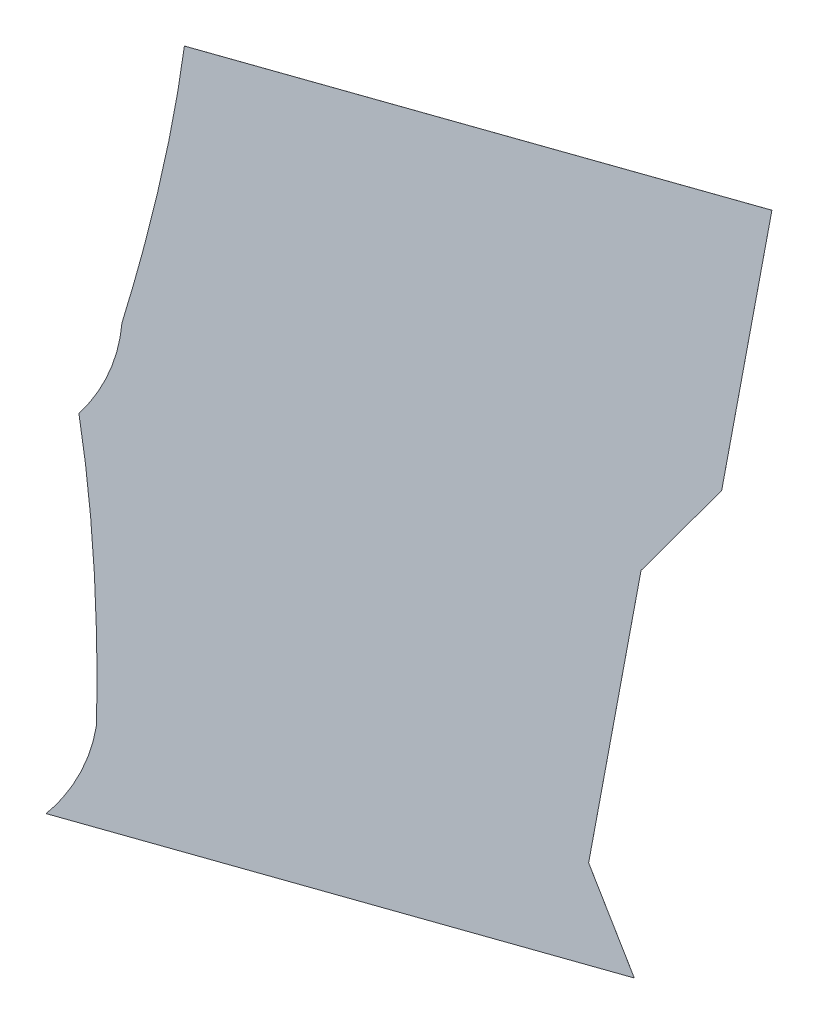
ISO-10303-21;
HEADER;
FILE_DESCRIPTION(('STEP AP214'),'2;1');
FILE_NAME('part.step','',(''),(''),'','','');
FILE_SCHEMA(('AUTOMOTIVE_DESIGN { 1 0 10303 214 1 1 1 1 }'));
ENDSEC;
DATA;
#1=APPLICATION_CONTEXT('core data for automotive mechanical design processes');
#2=APPLICATION_PROTOCOL_DEFINITION('international standard','automotive_design',2000,#1);
#3=PRODUCT_CONTEXT('',#1,'mechanical');
#4=PRODUCT('Part','Part','',(#3));
#5=PRODUCT_RELATED_PRODUCT_CATEGORY('part','',(#4));
#6=PRODUCT_DEFINITION_FORMATION('','',#4);
#7=PRODUCT_DEFINITION_CONTEXT('part definition',#1,'design');
#8=PRODUCT_DEFINITION('design','',#6,#7);
#9=PRODUCT_DEFINITION_SHAPE('','',#8);
#10=(LENGTH_UNIT() NAMED_UNIT(*) SI_UNIT(.MILLI.,.METRE.));
#11=(NAMED_UNIT(*) PLANE_ANGLE_UNIT() SI_UNIT($,.RADIAN.));
#12=(NAMED_UNIT(*) SI_UNIT($,.STERADIAN.) SOLID_ANGLE_UNIT());
#13=UNCERTAINTY_MEASURE_WITH_UNIT(LENGTH_MEASURE(1.E-05),#10,'distance_accuracy_value','');
#14=(GEOMETRIC_REPRESENTATION_CONTEXT(3) GLOBAL_UNCERTAINTY_ASSIGNED_CONTEXT((#13)) GLOBAL_UNIT_ASSIGNED_CONTEXT((#10,
#11,#12)) REPRESENTATION_CONTEXT('',''));
#15=CARTESIAN_POINT('',(0.,0.,0.));
#16=DIRECTION('',(0.,0.,1.));
#17=DIRECTION('',(1.,0.,0.));
#18=AXIS2_PLACEMENT_3D('',#15,#16,#17);
#19=CARTESIAN_POINT('',(151.680220925604,360.398931378131,313.47628043361));
#20=DIRECTION('',(0.887995978439146,-0.103444016227642,-0.448065260629073));
#21=DIRECTION('',(0.,-0.974370064785233,0.224951054343879));
#22=AXIS2_PLACEMENT_3D('',#19,#20,#21);
#23=PLANE('',#22);
#24=DIRECTION('',(0.459851217543135,0.199755631603012,0.865236699040776));
#25=VECTOR('',#24,1.);
#26=CARTESIAN_POINT('',(151.680220925604,360.418418779427,313.471781412523));
#27=LINE('',#26,#25);
#28=CARTESIAN_POINT('',(151.675622413428,360.416421223111,313.463129045533));
#29=VERTEX_POINT('',#28);
#30=CARTESIAN_POINT('',(151.680220925604,360.418418779427,313.471781412523));
#31=VERTEX_POINT('',#30);
#32=EDGE_CURVE('E505',#29,#31,#27,.T.);
#33=ORIENTED_EDGE('',*,*,#32,.F.);
#34=DIRECTION('',(0.,-0.974370064785233,0.224951054343879));
#35=VECTOR('',#34,1.);
#36=CARTESIAN_POINT('',(151.675622413428,360.396933821815,313.46762806662));
#37=LINE('',#36,#35);
#38=CARTESIAN_POINT('',(151.675622413428,434.624445357155,296.330856746703));
#39=VERTEX_POINT('',#38);
#40=EDGE_CURVE('E470',#39,#29,#37,.T.);
#41=ORIENTED_EDGE('',*,*,#40,.F.);
#42=DIRECTION('',(0.459851217543232,0.199755631604782,0.865236699040316));
#43=VECTOR('',#42,1.);
#44=CARTESIAN_POINT('',(151.680220925603,434.62644291347,296.339509113693));
#45=LINE('',#44,#43);
#46=CARTESIAN_POINT('',(151.680220925603,434.62644291347,296.339509113693));
#47=VERTEX_POINT('',#46);
#48=EDGE_CURVE('E514',#39,#47,#45,.T.);
#49=ORIENTED_EDGE('',*,*,#48,.T.);
#50=DIRECTION('',(0.,-0.974370064785233,0.224951054343879));
#51=VECTOR('',#50,1.);
#52=CARTESIAN_POINT('',(151.680220925604,360.398931378131,313.47628043361));
#53=LINE('',#52,#51);
#54=EDGE_CURVE('E476',#47,#31,#53,.T.);
#55=ORIENTED_EDGE('',*,*,#54,.T.);
#56=EDGE_LOOP('',(#33,#41,#49,#55));
#57=FACE_BOUND('',#56,.T.);
#58=ADVANCED_FACE('F231',(#57),#23,.T.);
#59=CARTESIAN_POINT('',(11.6802209255907,368.250898646985,386.069936995522));
#60=DIRECTION('',(-0.459851217543135,-0.199755631603012,-0.865236699040776));
#61=DIRECTION('',(0.123628089728887,-0.979282566119915,0.16038002096141));
#62=AXIS2_PLACEMENT_3D('',#59,#60,#61);
#63=ELLIPSE('',#62,146.750178018493,38.1);
#64=DIRECTION('',(-0.459851217543135,-0.199755631603012,-0.865236699040776));
#65=VECTOR('',#64,1.);
#66=SURFACE_OF_LINEAR_EXTRUSION('',#63,#65);
#67=DIRECTION('',(0.459851217553119,0.199755631607195,0.865236699034504));
#68=VECTOR('',#67,1.);
#69=CARTESIAN_POINT('',(29.5350343621642,448.852790168623,357.960589028568));
#70=LINE('',#69,#68);
#71=CARTESIAN_POINT('',(29.5350343621643,448.852790168623,357.960589028568));
#72=VERTEX_POINT('',#71);
#73=CARTESIAN_POINT('',(29.5396328743397,448.854787724939,357.969241395558));
#74=VERTEX_POINT('',#73);
#75=EDGE_CURVE('E571',#72,#74,#70,.T.);
#76=ORIENTED_EDGE('',*,*,#75,.F.);
#77=CARTESIAN_POINT('',(11.6756224134152,368.248901090669,386.061284628532));
#78=DIRECTION('',(-0.459851217543135,-0.199755631603012,-0.865236699040776));
#79=DIRECTION('',(0.123628089728887,-0.979282566119915,0.16038002096141));
#80=AXIS2_PLACEMENT_3D('',#77,#78,#79);
#81=ELLIPSE('',#80,146.750178018493,38.1);
#82=CARTESIAN_POINT('',(44.7456096076509,372.872862748157,367.417904990697));
#83=VERTEX_POINT('',#82);
#84=EDGE_CURVE('E480',#83,#72,#81,.F.);
#85=ORIENTED_EDGE('',*,*,#84,.F.);
#86=CARTESIAN_POINT('',(44.7456096076507,372.872862748157,367.417904990697));
#87=DIRECTION('',(0.459851217542959,0.199755631603108,0.865236699040847));
#88=VECTOR('',#87,1.);
#89=LINE('',#86,#88);
#90=CARTESIAN_POINT('',(44.750208119826,372.874860304473,367.426557357687));
#91=VERTEX_POINT('',#90);
#92=EDGE_CURVE('E489',#83,#91,#89,.T.);
#93=ORIENTED_EDGE('',*,*,#92,.T.);
#94=EDGE_CURVE('E479',#91,#74,#63,.F.);
#95=ORIENTED_EDGE('',*,*,#94,.T.);
#96=EDGE_LOOP('',(#76,#85,#93,#95));
#97=FACE_BOUND('',#96,.T.);
#98=ADVANCED_FACE('F496',(#97),#66,.F.);
#99=CARTESIAN_POINT('',(158.540110462806,532.810776324648,270.026013494281));
#100=DIRECTION('',(-0.459851217543135,-0.199755631603012,-0.865236699040776));
#101=DIRECTION('',(-0.88303358136935,0.,0.469309806177134));
#102=AXIS2_PLACEMENT_3D('',#99,#100,#101);
#103=PLANE('',#102);
#104=ORIENTED_EDGE('',*,*,#54,.F.);
#105=DIRECTION('',(0.40739376091098,0.818319076944367,-0.405443228923268));
#106=VECTOR('',#105,1.);
#107=CARTESIAN_POINT('',(151.680220925603,434.62644291347,296.339509113693));
#108=LINE('',#107,#106);
#109=CARTESIAN_POINT('',(151.691023901253,434.648142512015,296.328757860853));
#110=VERTEX_POINT('',#109);
#111=EDGE_CURVE('E561',#47,#110,#108,.T.);
#112=ORIENTED_EDGE('',*,*,#111,.T.);
#113=DIRECTION('',(-0.461479806504052,-0.778701236932887,0.425042082373233));
#114=VECTOR('',#113,1.);
#115=CARTESIAN_POINT('',(153.532901416258,437.756127474735,294.632312115188));
#116=LINE('',#115,#114);
#117=CARTESIAN_POINT('',(165.389197024359,457.762446116089,283.7121710744));
#118=VERTEX_POINT('',#117);
#119=EDGE_CURVE('E586',#118,#110,#116,.T.);
#120=ORIENTED_EDGE('',*,*,#119,.F.);
#121=DIRECTION('',(0.407393760911127,0.818319076943533,-0.405443228924805));
#122=VECTOR('',#121,1.);
#123=CARTESIAN_POINT('',(165.389197024359,457.762446116089,283.712171074399));
#124=LINE('',#123,#122);
#125=CARTESIAN_POINT('',(165.400000000008,457.784145714633,283.701419821559));
#126=VERTEX_POINT('',#125);
#127=EDGE_CURVE('E382',#118,#126,#124,.T.);
#128=ORIENTED_EDGE('',*,*,#127,.T.);
#129=DIRECTION('',(0.,-0.974370064785232,0.224951054343883));
#130=VECTOR('',#129,1.);
#131=CARTESIAN_POINT('',(165.400000000008,532.011657249972,266.564648501642));
#132=LINE('',#131,#130);
#133=CARTESIAN_POINT('',(165.400000000008,528.944340286029,267.272794420717));
#134=VERTEX_POINT('',#133);
#135=EDGE_CURVE('E370',#134,#126,#132,.T.);
#136=ORIENTED_EDGE('',*,*,#135,.F.);
#137=DIRECTION('',(-0.887995978439146,0.103444016227646,0.448065260629071));
#138=VECTOR('',#137,1.);
#139=CARTESIAN_POINT('',(178.529228317984,527.41489630187,260.648044702263));
#140=LINE('',#139,#138);
#141=CARTESIAN_POINT('',(37.7428251040463,543.815320777094,331.686087644713));
#142=VERTEX_POINT('',#141);
#143=EDGE_CURVE('E360',#134,#142,#140,.T.);
#144=ORIENTED_EDGE('',*,*,#143,.T.);
#145=CARTESIAN_POINT('',(-5.49560397189452E-12,468.575510617685,369.115914550579));
#146=DIRECTION('',(-0.459851217543135,-0.199755631603012,-0.865236699040776));
#147=DIRECTION('',(0.123628089728889,0.95047931378405,-0.285140613555117));
#148=AXIS2_PLACEMENT_3D('',#145,#146,#147);
#149=ELLIPSE('',#148,146.750178018493,38.1);
#150=CARTESIAN_POINT('',(35.0929894453342,472.963809633931,349.451767867731));
#151=VERTEX_POINT('',#150);
#152=EDGE_CURVE('E354',#151,#142,#149,.F.);
#153=ORIENTED_EDGE('',*,*,#152,.F.);
#154=DIRECTION('',(0.0162631616268608,0.972312119159766,-0.233119395394171));
#155=VECTOR('',#154,1.);
#156=CARTESIAN_POINT('',(35.1146516202199,474.258908068788,349.141257941792));
#157=LINE('',#156,#155);
#158=CARTESIAN_POINT('',(35.0926061893349,472.940896226231,349.457261535499));
#159=VERTEX_POINT('',#158);
#160=EDGE_CURVE('E387',#151,#159,#157,.F.);
#161=ORIENTED_EDGE('',*,*,#160,.T.);
#162=CARTESIAN_POINT('',(1.08355746927219,474.626220510447,367.143114969039));
#163=DIRECTION('',(-0.459851217543135,-0.199755631603012,-0.865236699040777));
#164=DIRECTION('',(0.408346031858665,-0.912805555850603,-0.00628772403605967));
#165=AXIS2_PLACEMENT_3D('',#162,#163,#164);
#166=ELLIPSE('',#165,39.8408559221603,38.1);
#167=CARTESIAN_POINT('',(29.5457266033037,448.877035910867,357.960866335735));
#168=VERTEX_POINT('',#167);
#169=EDGE_CURVE('E392',#168,#159,#166,.F.);
#170=ORIENTED_EDGE('',*,*,#169,.F.);
#171=DIRECTION('',(0.24830886703624,0.906574918937121,-0.341269135588514));
#172=VECTOR('',#171,1.);
#173=CARTESIAN_POINT('',(34.3183120304217,466.301730801358,351.401551226794));
#174=LINE('',#173,#172);
#175=EDGE_CURVE('E557',#168,#74,#174,.F.);
#176=ORIENTED_EDGE('',*,*,#175,.T.);
#177=ORIENTED_EDGE('',*,*,#94,.F.);
#178=DIRECTION('',(-0.126241724840681,0.979179490256282,-0.158967143682892));
#179=VECTOR('',#178,1.);
#180=CARTESIAN_POINT('',(45.8322516540238,364.48211347225,368.789097121692));
#181=LINE('',#180,#179);
#182=CARTESIAN_POINT('',(44.7532131423752,372.851552190998,367.430341366912));
#183=VERTEX_POINT('',#182);
#184=EDGE_CURVE('E471',#91,#183,#181,.F.);
#185=ORIENTED_EDGE('',*,*,#184,.T.);
#186=CARTESIAN_POINT('',(10.5966634563131,374.554059089428,385.190620879374));
#187=DIRECTION('',(-0.459851217543135,-0.199755631603012,-0.865236699040777));
#188=DIRECTION('',(0.408346031858667,0.817667842230929,-0.405798987242079));
#189=AXIS2_PLACEMENT_3D('',#186,#187,#188);
#190=ELLIPSE('',#189,39.8408559221603,38.1);
#191=CARTESIAN_POINT('',(37.5922025299442,348.95623707825,376.752903875654));
#192=VERTEX_POINT('',#191);
#193=EDGE_CURVE('E428',#192,#183,#190,.F.);
#194=ORIENTED_EDGE('',*,*,#193,.F.);
#195=DIRECTION('',(-0.887995978439146,0.103444016227646,0.448065260629071));
#196=VECTOR('',#195,1.);
#197=CARTESIAN_POINT('',(158.540110462806,334.866829406722,315.72497446348));
#198=LINE('',#197,#196);
#199=CARTESIAN_POINT('',(165.400000000008,334.067710332046,312.263609470842));
#200=VERTEX_POINT('',#199);
#201=EDGE_CURVE('E458',#200,#192,#198,.T.);
#202=ORIENTED_EDGE('',*,*,#201,.F.);
#203=DIRECTION('',(0.46147980650405,-0.88621822068465,-0.0406651388232901));
#204=VECTOR('',#203,1.);
#205=CARTESIAN_POINT('',(153.532901416258,356.857091022939,313.309326324616));
#206=LINE('',#205,#204);
#207=CARTESIAN_POINT('',(151.691023901253,360.394202270411,313.471630728379));
#208=VERTEX_POINT('',#207);
#209=EDGE_CURVE('E437',#208,#200,#206,.T.);
#210=ORIENTED_EDGE('',*,*,#209,.F.);
#211=DIRECTION('',(-0.407393760910533,0.913234927551786,0.00568248806907909));
#212=VECTOR('',#211,1.);
#213=CARTESIAN_POINT('',(151.691023901253,360.394202270411,313.471630728379));
#214=LINE('',#213,#212);
#215=EDGE_CURVE('E466',#208,#31,#214,.T.);
#216=ORIENTED_EDGE('',*,*,#215,.T.);
#217=EDGE_LOOP('',(#104,#112,#120,#128,#136,#144,#153,#161,#170,#176,#177,#185,#194,#202,#210,#216));
#218=FACE_BOUND('',#217,.T.);
#219=ADVANCED_FACE('F233',(#218),#103,.F.);
#220=CARTESIAN_POINT('',(158.535511950631,359.597814747139,310.006263073981));
#221=DIRECTION('',(-0.459851217543135,-0.199755631603012,-0.865236699040776));
#222=DIRECTION('',(0.88303358136935,-0.205731877933245,-0.421812859661817));
#223=AXIS2_PLACEMENT_3D('',#220,#221,#222);
#224=PLANE('',#223);
#225=ORIENTED_EDGE('',*,*,#40,.T.);
#226=DIRECTION('',(-0.407393760910533,0.913234927551786,0.00568248806907909));
#227=VECTOR('',#226,1.);
#228=CARTESIAN_POINT('',(151.686425389077,360.392204714095,313.462978361389));
#229=LINE('',#228,#227);
#230=CARTESIAN_POINT('',(151.686425389077,360.392204714095,313.462978361389));
#231=VERTEX_POINT('',#230);
#232=EDGE_CURVE('E472',#231,#29,#229,.T.);
#233=ORIENTED_EDGE('',*,*,#232,.F.);
#234=DIRECTION('',(0.46147980650405,-0.88621822068465,-0.0406651388232901));
#235=VECTOR('',#234,1.);
#236=CARTESIAN_POINT('',(153.528302904082,356.855093466623,313.300673957626));
#237=LINE('',#236,#235);
#238=CARTESIAN_POINT('',(165.395401487833,334.06571277573,312.254957103851));
#239=VERTEX_POINT('',#238);
#240=EDGE_CURVE('E433',#231,#239,#237,.T.);
#241=ORIENTED_EDGE('',*,*,#240,.T.);
#242=DIRECTION('',(-0.887995978439146,0.103444016227646,0.448065260629071));
#243=VECTOR('',#242,1.);
#244=CARTESIAN_POINT('',(158.53551195063,334.864831850405,315.71632209649));
#245=LINE('',#244,#243);
#246=CARTESIAN_POINT('',(37.5876040177687,348.954239521934,376.744251508664));
#247=VERTEX_POINT('',#246);
#248=EDGE_CURVE('E449',#239,#247,#245,.T.);
#249=ORIENTED_EDGE('',*,*,#248,.T.);
#250=CARTESIAN_POINT('',(10.5920649441376,374.552061533112,385.181968512383));
#251=DIRECTION('',(-0.459851217543135,-0.199755631603012,-0.865236699040777));
#252=DIRECTION('',(0.408346031858667,0.817667842230929,-0.405798987242079));
#253=AXIS2_PLACEMENT_3D('',#250,#251,#252);
#254=ELLIPSE('',#253,39.8408559221603,38.1);
#255=CARTESIAN_POINT('',(44.7486146301999,372.849554634682,367.421688999922));
#256=VERTEX_POINT('',#255);
#257=EDGE_CURVE('E446',#247,#256,#254,.F.);
#258=ORIENTED_EDGE('',*,*,#257,.T.);
#259=DIRECTION('',(-0.126241724840681,0.979179490256282,-0.158967143682892));
#260=VECTOR('',#259,1.);
#261=CARTESIAN_POINT('',(45.8276531418485,364.480115915934,368.780444754701));
#262=LINE('',#261,#260);
#263=EDGE_CURVE('E441',#83,#256,#262,.F.);
#264=ORIENTED_EDGE('',*,*,#263,.F.);
#265=ORIENTED_EDGE('',*,*,#84,.T.);
#266=DIRECTION('',(0.24830886703624,0.906574918937121,-0.341269135588514));
#267=VECTOR('',#266,1.);
#268=CARTESIAN_POINT('',(34.3137135182462,466.299733245042,351.392898859804));
#269=LINE('',#268,#267);
#270=CARTESIAN_POINT('',(29.5411280911281,448.875038354551,357.952213968745));
#271=VERTEX_POINT('',#270);
#272=EDGE_CURVE('E396',#271,#72,#269,.F.);
#273=ORIENTED_EDGE('',*,*,#272,.F.);
#274=CARTESIAN_POINT('',(1.07895895709667,474.624222954131,367.134462602049));
#275=DIRECTION('',(-0.459851217543135,-0.199755631603012,-0.865236699040777));
#276=DIRECTION('',(0.408346031858665,-0.912805555850603,-0.00628772403605967));
#277=AXIS2_PLACEMENT_3D('',#274,#275,#276);
#278=ELLIPSE('',#277,39.8408559221603,38.1);
#279=CARTESIAN_POINT('',(35.0880076771595,472.938898669914,349.448609168509));
#280=VERTEX_POINT('',#279);
#281=EDGE_CURVE('E249',#271,#280,#278,.F.);
#282=ORIENTED_EDGE('',*,*,#281,.T.);
#283=DIRECTION('',(0.0162631616268608,0.972312119159766,-0.233119395394171));
#284=VECTOR('',#283,1.);
#285=CARTESIAN_POINT('',(35.1100531080445,474.256910512472,349.132605574802));
#286=LINE('',#285,#284);
#287=CARTESIAN_POINT('',(35.0883909331589,472.961812077615,349.443115500741));
#288=VERTEX_POINT('',#287);
#289=EDGE_CURVE('E367',#288,#280,#286,.F.);
#290=ORIENTED_EDGE('',*,*,#289,.F.);
#291=CARTESIAN_POINT('',(-0.00459851218090335,468.573513061369,369.107262183589));
#292=DIRECTION('',(-0.459851217543135,-0.199755631603012,-0.865236699040776));
#293=DIRECTION('',(0.123628089728889,0.95047931378405,-0.285140613555117));
#294=AXIS2_PLACEMENT_3D('',#291,#292,#293);
#295=ELLIPSE('',#294,146.750178018493,38.1);
#296=CARTESIAN_POINT('',(37.7382265918709,543.813323220778,331.677435277722));
#297=VERTEX_POINT('',#296);
#298=EDGE_CURVE('E352',#288,#297,#295,.F.);
#299=ORIENTED_EDGE('',*,*,#298,.T.);
#300=DIRECTION('',(-0.887995978439146,0.103444016227646,0.448065260629071));
#301=VECTOR('',#300,1.);
#302=CARTESIAN_POINT('',(178.524629805809,527.412898745553,260.639392335273));
#303=LINE('',#302,#301);
#304=CARTESIAN_POINT('',(165.395401487833,528.942342729713,267.264142053726));
#305=VERTEX_POINT('',#304);
#306=EDGE_CURVE('E361',#305,#297,#303,.T.);
#307=ORIENTED_EDGE('',*,*,#306,.F.);
#308=DIRECTION('',(0.,-0.974370064785232,0.224951054343883));
#309=VECTOR('',#308,1.);
#310=CARTESIAN_POINT('',(165.395401487833,532.009659693656,266.555996134652));
#311=LINE('',#310,#309);
#312=CARTESIAN_POINT('',(165.395401487832,457.782148158317,283.692767454569));
#313=VERTEX_POINT('',#312);
#314=EDGE_CURVE('E369',#305,#313,#311,.T.);
#315=ORIENTED_EDGE('',*,*,#314,.T.);
#316=DIRECTION('',(0.407393760911127,0.818319076943533,-0.405443228924805));
#317=VECTOR('',#316,1.);
#318=CARTESIAN_POINT('',(165.384598512183,457.760448559773,283.703518707409));
#319=LINE('',#318,#317);
#320=CARTESIAN_POINT('',(165.384598512183,457.760448559772,283.703518707409));
#321=VERTEX_POINT('',#320);
#322=EDGE_CURVE('E388',#321,#313,#319,.T.);
#323=ORIENTED_EDGE('',*,*,#322,.F.);
#324=DIRECTION('',(-0.461479806504052,-0.778701236932887,0.425042082373233));
#325=VECTOR('',#324,1.);
#326=CARTESIAN_POINT('',(153.528302904082,437.754129918419,294.623659748197));
#327=LINE('',#326,#325);
#328=CARTESIAN_POINT('',(151.686425389077,434.646144955699,296.320105493863));
#329=VERTEX_POINT('',#328);
#330=EDGE_CURVE('E257',#321,#329,#327,.T.);
#331=ORIENTED_EDGE('',*,*,#330,.T.);
#332=DIRECTION('',(0.40739376091098,0.818319076944367,-0.405443228923268));
#333=VECTOR('',#332,1.);
#334=CARTESIAN_POINT('',(151.675622413428,434.624445357155,296.330856746703));
#335=LINE('',#334,#333);
#336=EDGE_CURVE('E435',#39,#329,#335,.T.);
#337=ORIENTED_EDGE('',*,*,#336,.F.);
#338=EDGE_LOOP('',(#225,#233,#241,#249,#258,#264,#265,#273,#282,#290,#299,#307,#315,#323,#331,#337));
#339=FACE_BOUND('',#338,.T.);
#340=ADVANCED_FACE('F364',(#339),#224,.T.);
#341=CARTESIAN_POINT('',(44.750208119826,372.874860304473,367.426557357687));
#342=DIRECTION('',(0.878976612109096,0.0361277387107882,-0.475494376266283));
#343=DIRECTION('',(0.475988746003179,-0.00605354861897453,0.879430536328731));
#344=AXIS2_PLACEMENT_3D('',#341,#342,#343);
#345=PLANE('',#344);
#346=ORIENTED_EDGE('',*,*,#92,.F.);
#347=ORIENTED_EDGE('',*,*,#263,.T.);
#348=DIRECTION('',(0.459851217542939,0.199755631601894,0.865236699041138));
#349=VECTOR('',#348,1.);
#350=CARTESIAN_POINT('',(44.7486146301998,372.849554634682,367.421688999921));
#351=LINE('',#350,#349);
#352=EDGE_CURVE('E465',#256,#183,#351,.T.);
#353=ORIENTED_EDGE('',*,*,#352,.T.);
#354=ORIENTED_EDGE('',*,*,#184,.F.);
#355=EDGE_LOOP('',(#346,#347,#353,#354));
#356=FACE_BOUND('',#355,.T.);
#357=ADVANCED_FACE('F529',(#356),#345,.F.);
#358=CARTESIAN_POINT('',(151.688724645165,360.393203492253,313.467304544884));
#359=DIRECTION('',(0.789029265170334,0.355105131957277,-0.501331391359415));
#360=DIRECTION('',(-0.407393760910533,0.913234927551786,0.00568248806907909));
#361=AXIS2_PLACEMENT_3D('',#358,#359,#360);
#362=PLANE('',#361);
#363=ORIENTED_EDGE('',*,*,#232,.T.);
#364=ORIENTED_EDGE('',*,*,#32,.T.);
#365=ORIENTED_EDGE('',*,*,#215,.F.);
#366=DIRECTION('',(0.459851217543211,0.199755631603073,0.865236699040722));
#367=VECTOR('',#366,1.);
#368=CARTESIAN_POINT('',(151.691023901253,360.394202270411,313.471630728379));
#369=LINE('',#368,#367);
#370=EDGE_CURVE('E442',#231,#208,#369,.T.);
#371=ORIENTED_EDGE('',*,*,#370,.F.);
#372=EDGE_LOOP('',(#363,#364,#365,#371));
#373=FACE_BOUND('',#372,.T.);
#374=ADVANCED_FACE('F421',(#373),#362,.T.);
#375=CARTESIAN_POINT('',(158.540110462806,334.866829406722,315.72497446348));
#376=DIRECTION('',(0.,-0.974370064785232,0.224951054343881));
#377=DIRECTION('',(-0.887995978439146,0.103444016227646,0.448065260629071));
#378=AXIS2_PLACEMENT_3D('',#375,#376,#377);
#379=PLANE('',#378);
#380=DIRECTION('',(0.459851217543135,0.199755631603012,0.865236699040777));
#381=VECTOR('',#380,1.);
#382=CARTESIAN_POINT('',(37.5922025299442,348.95623707825,376.752903875654));
#383=LINE('',#382,#381);
#384=EDGE_CURVE('E434',#247,#192,#383,.T.);
#385=ORIENTED_EDGE('',*,*,#384,.F.);
#386=ORIENTED_EDGE('',*,*,#248,.F.);
#387=DIRECTION('',(0.459851217543135,0.199755631603012,0.865236699040777));
#388=VECTOR('',#387,1.);
#389=CARTESIAN_POINT('',(165.400000000008,334.067710332046,312.263609470842));
#390=LINE('',#389,#388);
#391=EDGE_CURVE('E462',#239,#200,#390,.T.);
#392=ORIENTED_EDGE('',*,*,#391,.T.);
#393=ORIENTED_EDGE('',*,*,#201,.T.);
#394=EDGE_LOOP('',(#385,#386,#392,#393));
#395=FACE_BOUND('',#394,.T.);
#396=ADVANCED_FACE('F417',(#395),#379,.T.);
#397=DIRECTION('',(-0.459851217543135,-0.199755631603012,-0.865236699040777));
#398=VECTOR('',#397,1.);
#399=SURFACE_OF_LINEAR_EXTRUSION('',#190,#398);
#400=ORIENTED_EDGE('',*,*,#352,.F.);
#401=ORIENTED_EDGE('',*,*,#257,.F.);
#402=ORIENTED_EDGE('',*,*,#384,.T.);
#403=ORIENTED_EDGE('',*,*,#193,.T.);
#404=EDGE_LOOP('',(#400,#401,#402,#403));
#405=FACE_BOUND('',#404,.T.);
#406=ADVANCED_FACE('F420',(#405),#399,.F.);
#407=CARTESIAN_POINT('',(153.532901416258,356.857091022939,313.309326324616));
#408=DIRECTION('',(0.758665437405106,0.417989178052991,-0.499711718010999));
#409=DIRECTION('',(0.46147980650405,-0.88621822068465,-0.0406651388232901));
#410=AXIS2_PLACEMENT_3D('',#407,#408,#409);
#411=PLANE('',#410);
#412=ORIENTED_EDGE('',*,*,#391,.F.);
#413=ORIENTED_EDGE('',*,*,#240,.F.);
#414=ORIENTED_EDGE('',*,*,#370,.T.);
#415=ORIENTED_EDGE('',*,*,#209,.T.);
#416=EDGE_LOOP('',(#412,#413,#414,#415));
#417=FACE_BOUND('',#416,.T.);
#418=ADVANCED_FACE('F415',(#417),#411,.T.);
#419=CARTESIAN_POINT('',(29.5457266033037,448.877035910867,357.960866335735));
#420=DIRECTION('',(0.852572322015069,-0.371778971969583,-0.367288485709902));
#421=DIRECTION('',(-0.320721520793321,-0.927101855011449,0.193958388667131));
#422=AXIS2_PLACEMENT_3D('',#419,#420,#421);
#423=PLANE('',#422);
#424=DIRECTION('',(-0.459851217555838,-0.199755631602825,-0.865236699034068));
#425=VECTOR('',#424,1.);
#426=CARTESIAN_POINT('',(29.5457266033037,448.877035910867,357.960866335735));
#427=LINE('',#426,#425);
#428=EDGE_CURVE('E397',#271,#168,#427,.F.);
#429=ORIENTED_EDGE('',*,*,#428,.F.);
#430=ORIENTED_EDGE('',*,*,#272,.T.);
#431=ORIENTED_EDGE('',*,*,#75,.T.);
#432=ORIENTED_EDGE('',*,*,#175,.F.);
#433=EDGE_LOOP('',(#429,#430,#431,#432));
#434=FACE_BOUND('',#433,.T.);
#435=ADVANCED_FACE('F411',(#434),#423,.F.);
#436=CARTESIAN_POINT('',(151.677921669516,434.625444135313,296.335182930198));
#437=DIRECTION('',(0.789029265170171,-0.538935595365409,-0.294925825849742));
#438=DIRECTION('',(0.40739376091098,0.818319076944367,-0.405443228923268));
#439=AXIS2_PLACEMENT_3D('',#436,#437,#438);
#440=PLANE('',#439);
#441=ORIENTED_EDGE('',*,*,#336,.T.);
#442=DIRECTION('',(0.459851217543135,0.199755631603012,0.865236699040777));
#443=VECTOR('',#442,1.);
#444=CARTESIAN_POINT('',(151.691023901253,434.648142512015,296.328757860853));
#445=LINE('',#444,#443);
#446=EDGE_CURVE('E386',#329,#110,#445,.T.);
#447=ORIENTED_EDGE('',*,*,#446,.T.);
#448=ORIENTED_EDGE('',*,*,#111,.F.);
#449=ORIENTED_EDGE('',*,*,#48,.F.);
#450=EDGE_LOOP('',(#441,#447,#448,#449));
#451=FACE_BOUND('',#450,.T.);
#452=ADVANCED_FACE('F408',(#451),#440,.T.);
#453=CARTESIAN_POINT('',(153.532901416258,437.756127474735,294.632312115188));
#454=DIRECTION('',(0.758665437405105,-0.594745383539943,-0.265903521685681));
#455=DIRECTION('',(-0.461479806504052,-0.778701236932887,0.425042082373233));
#456=AXIS2_PLACEMENT_3D('',#453,#454,#455);
#457=PLANE('',#456);
#458=ORIENTED_EDGE('',*,*,#446,.F.);
#459=ORIENTED_EDGE('',*,*,#330,.F.);
#460=DIRECTION('',(0.459851217543048,0.199755631603025,0.86523669904082));
#461=VECTOR('',#460,1.);
#462=CARTESIAN_POINT('',(165.389197024359,457.762446116089,283.7121710744));
#463=LINE('',#462,#461);
#464=EDGE_CURVE('E241',#321,#118,#463,.T.);
#465=ORIENTED_EDGE('',*,*,#464,.T.);
#466=ORIENTED_EDGE('',*,*,#119,.T.);
#467=EDGE_LOOP('',(#458,#459,#465,#466));
#468=FACE_BOUND('',#467,.T.);
#469=ADVANCED_FACE('F405',(#468),#457,.T.);
#470=DIRECTION('',(-0.459851217543135,-0.199755631603012,-0.865236699040777));
#471=VECTOR('',#470,1.);
#472=SURFACE_OF_LINEAR_EXTRUSION('',#166,#471);
#473=DIRECTION('',(0.459851217534712,0.199755631601636,0.86523669904557));
#474=VECTOR('',#473,1.);
#475=CARTESIAN_POINT('',(35.0880076771595,472.938898669914,349.448609168509));
#476=LINE('',#475,#474);
#477=EDGE_CURVE('E13',#280,#159,#476,.T.);
#478=ORIENTED_EDGE('',*,*,#477,.F.);
#479=ORIENTED_EDGE('',*,*,#281,.F.);
#480=ORIENTED_EDGE('',*,*,#428,.T.);
#481=ORIENTED_EDGE('',*,*,#169,.T.);
#482=EDGE_LOOP('',(#478,#479,#480,#481));
#483=FACE_BOUND('',#482,.T.);
#484=ADVANCED_FACE('F400',(#483),#472,.F.);
#485=CARTESIAN_POINT('',(35.0929894453342,472.963809633931,349.451767867731));
#486=DIRECTION('',(0.887847040489353,-0.121271722085035,-0.443870253696761));
#487=DIRECTION('',(-0.447170664894423,0.,-0.894448655014853));
#488=AXIS2_PLACEMENT_3D('',#485,#486,#487);
#489=PLANE('',#488);
#490=DIRECTION('',(-0.459851217534749,-0.199755631606902,-0.865236699044335));
#491=VECTOR('',#490,1.);
#492=CARTESIAN_POINT('',(35.0929894453342,472.963809633931,349.451767867731));
#493=LINE('',#492,#491);
#494=EDGE_CURVE('E235',#288,#151,#493,.F.);
#495=ORIENTED_EDGE('',*,*,#494,.F.);
#496=ORIENTED_EDGE('',*,*,#289,.T.);
#497=ORIENTED_EDGE('',*,*,#477,.T.);
#498=ORIENTED_EDGE('',*,*,#160,.F.);
#499=EDGE_LOOP('',(#495,#496,#497,#498));
#500=FACE_BOUND('',#499,.T.);
#501=ADVANCED_FACE('F404',(#500),#489,.F.);
#502=CARTESIAN_POINT('',(165.386897768271,457.761447337931,283.707844890904));
#503=DIRECTION('',(0.789029265169756,-0.538935595366243,-0.294925825849329));
#504=DIRECTION('',(0.407393760911127,0.818319076943533,-0.405443228924805));
#505=AXIS2_PLACEMENT_3D('',#502,#503,#504);
#506=PLANE('',#505);
#507=ORIENTED_EDGE('',*,*,#322,.T.);
#508=DIRECTION('',(0.459851217543135,0.199755631603012,0.865236699040776));
#509=VECTOR('',#508,1.);
#510=CARTESIAN_POINT('',(165.400000000008,457.784145714633,283.701419821559));
#511=LINE('',#510,#509);
#512=EDGE_CURVE('E375',#313,#126,#511,.T.);
#513=ORIENTED_EDGE('',*,*,#512,.T.);
#514=ORIENTED_EDGE('',*,*,#127,.F.);
#515=ORIENTED_EDGE('',*,*,#464,.F.);
#516=EDGE_LOOP('',(#507,#513,#514,#515));
#517=FACE_BOUND('',#516,.T.);
#518=ADVANCED_FACE('F597',(#517),#506,.T.);
#519=CARTESIAN_POINT('',(178.529228317984,527.41489630187,260.648044702263));
#520=DIRECTION('',(0.,-0.974370064785232,0.224951054343881));
#521=DIRECTION('',(-0.887995978439146,0.103444016227646,0.448065260629071));
#522=AXIS2_PLACEMENT_3D('',#519,#520,#521);
#523=PLANE('',#522);
#524=DIRECTION('',(0.459851217543135,0.199755631603012,0.865236699040776));
#525=VECTOR('',#524,1.);
#526=CARTESIAN_POINT('',(165.400000000008,528.944340286029,267.272794420717));
#527=LINE('',#526,#525);
#528=EDGE_CURVE('E373',#305,#134,#527,.T.);
#529=ORIENTED_EDGE('',*,*,#528,.F.);
#530=ORIENTED_EDGE('',*,*,#306,.T.);
#531=DIRECTION('',(0.459851217543135,0.199755631603012,0.865236699040776));
#532=VECTOR('',#531,1.);
#533=CARTESIAN_POINT('',(37.7428251040463,543.815320777094,331.686087644713));
#534=LINE('',#533,#532);
#535=EDGE_CURVE('E348',#297,#142,#534,.T.);
#536=ORIENTED_EDGE('',*,*,#535,.T.);
#537=ORIENTED_EDGE('',*,*,#143,.F.);
#538=EDGE_LOOP('',(#529,#530,#536,#537));
#539=FACE_BOUND('',#538,.T.);
#540=ADVANCED_FACE('F372',(#539),#523,.F.);
#541=CARTESIAN_POINT('',(165.400000000008,532.011657249972,266.564648501642));
#542=DIRECTION('',(0.887995978439146,-0.103444016227651,-0.448065260629071));
#543=DIRECTION('',(0.,-0.974370064785232,0.224951054343883));
#544=AXIS2_PLACEMENT_3D('',#541,#542,#543);
#545=PLANE('',#544);
#546=ORIENTED_EDGE('',*,*,#512,.F.);
#547=ORIENTED_EDGE('',*,*,#314,.F.);
#548=ORIENTED_EDGE('',*,*,#528,.T.);
#549=ORIENTED_EDGE('',*,*,#135,.T.);
#550=EDGE_LOOP('',(#546,#547,#548,#549));
#551=FACE_BOUND('',#550,.T.);
#552=ADVANCED_FACE('F615',(#551),#545,.T.);
#553=DIRECTION('',(-0.459851217543135,-0.199755631603012,-0.865236699040776));
#554=VECTOR('',#553,1.);
#555=SURFACE_OF_LINEAR_EXTRUSION('',#149,#554);
#556=ORIENTED_EDGE('',*,*,#535,.F.);
#557=ORIENTED_EDGE('',*,*,#298,.F.);
#558=ORIENTED_EDGE('',*,*,#494,.T.);
#559=ORIENTED_EDGE('',*,*,#152,.T.);
#560=EDGE_LOOP('',(#556,#557,#558,#559));
#561=FACE_BOUND('',#560,.T.);
#562=ADVANCED_FACE('F350',(#561),#555,.F.);
#563=CLOSED_SHELL('',(#58,#98,#219,#340,#357,#374,#396,#406,#418,#435,#452,#469,#484,#501,#518,
#540,#552,#562));
#564=MANIFOLD_SOLID_BREP('B2',#563);
#565=ADVANCED_BREP_SHAPE_REPRESENTATION('',(#18,#564),#14);
#566=SHAPE_DEFINITION_REPRESENTATION(#9,#565);
ENDSEC;
END-ISO-10303-21;
